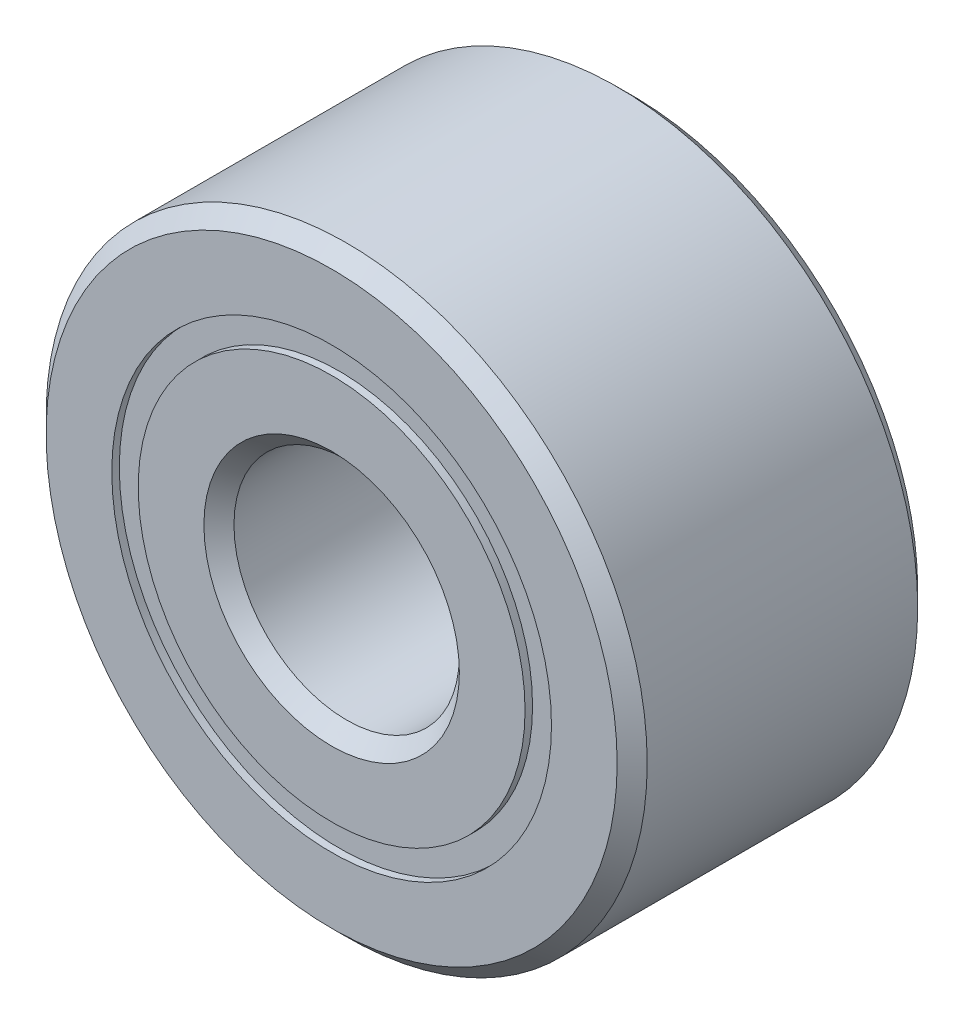
ISO-10303-21;
HEADER;
FILE_DESCRIPTION(('STEP AP214'),'2;1');
FILE_NAME('part.step','',(''),(''),'','','');
FILE_SCHEMA(('AUTOMOTIVE_DESIGN { 1 0 10303 214 1 1 1 1 }'));
ENDSEC;
DATA;
#1=APPLICATION_CONTEXT('core data for automotive mechanical design processes');
#2=APPLICATION_PROTOCOL_DEFINITION('international standard','automotive_design',2000,#1);
#3=PRODUCT_CONTEXT('',#1,'mechanical');
#4=PRODUCT('Part','Part','',(#3));
#5=PRODUCT_RELATED_PRODUCT_CATEGORY('part','',(#4));
#6=PRODUCT_DEFINITION_FORMATION('','',#4);
#7=PRODUCT_DEFINITION_CONTEXT('part definition',#1,'design');
#8=PRODUCT_DEFINITION('design','',#6,#7);
#9=PRODUCT_DEFINITION_SHAPE('','',#8);
#10=(LENGTH_UNIT() NAMED_UNIT(*) SI_UNIT(.MILLI.,.METRE.));
#11=(NAMED_UNIT(*) PLANE_ANGLE_UNIT() SI_UNIT($,.RADIAN.));
#12=(NAMED_UNIT(*) SI_UNIT($,.STERADIAN.) SOLID_ANGLE_UNIT());
#13=UNCERTAINTY_MEASURE_WITH_UNIT(LENGTH_MEASURE(1.E-05),#10,'distance_accuracy_value','');
#14=(GEOMETRIC_REPRESENTATION_CONTEXT(3) GLOBAL_UNCERTAINTY_ASSIGNED_CONTEXT((#13)) GLOBAL_UNIT_ASSIGNED_CONTEXT((#10,
#11,#12)) REPRESENTATION_CONTEXT('',''));
#15=CARTESIAN_POINT('',(0.,0.,0.));
#16=DIRECTION('',(0.,0.,1.));
#17=DIRECTION('',(1.,0.,0.));
#18=AXIS2_PLACEMENT_3D('',#15,#16,#17);
#19=CARTESIAN_POINT('',(0.,2.92582417582418,-1.9));
#20=DIRECTION('',(0.,0.,1.));
#21=DIRECTION('',(1.,0.,0.));
#22=AXIS2_PLACEMENT_3D('',#19,#20,#21);
#23=PLANE('',#22);
#24=CARTESIAN_POINT('',(0.,0.,-1.9));
#25=DIRECTION('',(0.,0.,1.));
#26=DIRECTION('',(1.,0.,0.));
#27=AXIS2_PLACEMENT_3D('',#24,#25,#26);
#28=CIRCLE('',#27,2.92582417582418);
#29=CARTESIAN_POINT('',(2.92582417582418,0.,-1.9));
#30=VERTEX_POINT('',#29);
#31=EDGE_CURVE('E55',#30,#30,#28,.T.);
#32=ORIENTED_EDGE('',*,*,#31,.F.);
#33=EDGE_LOOP('',(#32));
#34=FACE_BOUND('',#33,.T.);
#35=CARTESIAN_POINT('',(0.,0.,-1.9));
#36=DIRECTION('',(0.,0.,1.));
#37=DIRECTION('',(1.,0.,0.));
#38=AXIS2_PLACEMENT_3D('',#35,#36,#37);
#39=CIRCLE('',#38,2.57417582417583);
#40=CARTESIAN_POINT('',(2.57417582417583,0.,-1.9));
#41=VERTEX_POINT('',#40);
#42=EDGE_CURVE('E11',#41,#41,#39,.T.);
#43=ORIENTED_EDGE('',*,*,#42,.T.);
#44=EDGE_LOOP('',(#43));
#45=FACE_BOUND('',#44,.T.);
#46=ADVANCED_FACE('F41',(#34,#45),#23,.F.);
#47=CARTESIAN_POINT('',(0.,0.,2.));
#48=DIRECTION('',(0.,0.,1.));
#49=DIRECTION('',(1.,0.,0.));
#50=AXIS2_PLACEMENT_3D('',#47,#48,#49);
#51=CYLINDRICAL_SURFACE('',#50,2.57417582417583);
#52=ORIENTED_EDGE('',*,*,#42,.F.);
#53=EDGE_LOOP('',(#52));
#54=FACE_BOUND('',#53,.T.);
#55=CARTESIAN_POINT('',(0.,0.,-0.90611125012019));
#56=DIRECTION('',(0.,0.,1.));
#57=DIRECTION('',(1.,0.,0.));
#58=AXIS2_PLACEMENT_3D('',#55,#56,#57);
#59=CIRCLE('',#58,2.57417582417583);
#60=CARTESIAN_POINT('',(2.57417582417583,0.,-0.90611125012019));
#61=VERTEX_POINT('',#60);
#62=EDGE_CURVE('E47',#61,#61,#59,.T.);
#63=ORIENTED_EDGE('',*,*,#62,.T.);
#64=EDGE_LOOP('',(#63));
#65=FACE_BOUND('',#64,.T.);
#66=ADVANCED_FACE('F64',(#54,#65),#51,.F.);
#67=CARTESIAN_POINT('',(0.,2.92582417582418,-0.90611125012019));
#68=DIRECTION('',(0.,0.,-1.));
#69=DIRECTION('',(-1.,0.,0.));
#70=AXIS2_PLACEMENT_3D('',#67,#68,#69);
#71=PLANE('',#70);
#72=ORIENTED_EDGE('',*,*,#62,.F.);
#73=EDGE_LOOP('',(#72));
#74=FACE_BOUND('',#73,.T.);
#75=CARTESIAN_POINT('',(0.,0.,-0.90611125012019));
#76=DIRECTION('',(0.,0.,1.));
#77=DIRECTION('',(1.,0.,0.));
#78=AXIS2_PLACEMENT_3D('',#75,#76,#77);
#79=CIRCLE('',#78,2.92582417582418);
#80=CARTESIAN_POINT('',(2.92582417582418,0.,-0.90611125012019));
#81=VERTEX_POINT('',#80);
#82=EDGE_CURVE('E51',#81,#81,#79,.T.);
#83=ORIENTED_EDGE('',*,*,#82,.T.);
#84=EDGE_LOOP('',(#83));
#85=FACE_BOUND('',#84,.T.);
#86=ADVANCED_FACE('F68',(#74,#85),#71,.F.);
#87=CARTESIAN_POINT('',(0.,0.,2.));
#88=DIRECTION('',(0.,0.,1.));
#89=DIRECTION('',(1.,0.,0.));
#90=AXIS2_PLACEMENT_3D('',#87,#88,#89);
#91=CYLINDRICAL_SURFACE('',#90,2.92582417582418);
#92=ORIENTED_EDGE('',*,*,#82,.F.);
#93=EDGE_LOOP('',(#92));
#94=FACE_BOUND('',#93,.T.);
#95=ORIENTED_EDGE('',*,*,#31,.T.);
#96=EDGE_LOOP('',(#95));
#97=FACE_BOUND('',#96,.T.);
#98=ADVANCED_FACE('F61',(#94,#97),#91,.T.);
#99=CLOSED_SHELL('',(#46,#66,#86,#98));
#100=MANIFOLD_SOLID_BREP('B2',#99);
#101=CARTESIAN_POINT('',(0.,2.92582417582418,1.9));
#102=DIRECTION('',(0.,0.,-1.));
#103=DIRECTION('',(-1.,0.,0.));
#104=AXIS2_PLACEMENT_3D('',#101,#102,#103);
#105=PLANE('',#104);
#106=CARTESIAN_POINT('',(0.,0.,1.9));
#107=DIRECTION('',(0.,0.,1.));
#108=DIRECTION('',(1.,0.,0.));
#109=AXIS2_PLACEMENT_3D('',#106,#107,#108);
#110=CIRCLE('',#109,2.57417582417583);
#111=CARTESIAN_POINT('',(2.57417582417583,0.,1.9));
#112=VERTEX_POINT('',#111);
#113=EDGE_CURVE('E40',#112,#112,#110,.T.);
#114=ORIENTED_EDGE('',*,*,#113,.F.);
#115=EDGE_LOOP('',(#114));
#116=FACE_BOUND('',#115,.T.);
#117=CARTESIAN_POINT('',(0.,0.,1.9));
#118=DIRECTION('',(0.,0.,1.));
#119=DIRECTION('',(1.,0.,0.));
#120=AXIS2_PLACEMENT_3D('',#117,#118,#119);
#121=CIRCLE('',#120,2.92582417582418);
#122=CARTESIAN_POINT('',(2.92582417582418,0.,1.9));
#123=VERTEX_POINT('',#122);
#124=EDGE_CURVE('E122',#123,#123,#121,.T.);
#125=ORIENTED_EDGE('',*,*,#124,.T.);
#126=EDGE_LOOP('',(#125));
#127=FACE_BOUND('',#126,.T.);
#128=ADVANCED_FACE('F108',(#116,#127),#105,.F.);
#129=CARTESIAN_POINT('',(0.,0.,2.));
#130=DIRECTION('',(0.,0.,1.));
#131=DIRECTION('',(1.,0.,0.));
#132=AXIS2_PLACEMENT_3D('',#129,#130,#131);
#133=CYLINDRICAL_SURFACE('',#132,2.57417582417583);
#134=CARTESIAN_POINT('',(0.,0.,0.90611125012019));
#135=DIRECTION('',(0.,0.,1.));
#136=DIRECTION('',(1.,0.,0.));
#137=AXIS2_PLACEMENT_3D('',#134,#135,#136);
#138=CIRCLE('',#137,2.57417582417583);
#139=CARTESIAN_POINT('',(2.57417582417583,0.,0.90611125012019));
#140=VERTEX_POINT('',#139);
#141=EDGE_CURVE('E114',#140,#140,#138,.T.);
#142=ORIENTED_EDGE('',*,*,#141,.F.);
#143=EDGE_LOOP('',(#142));
#144=FACE_BOUND('',#143,.T.);
#145=ORIENTED_EDGE('',*,*,#113,.T.);
#146=EDGE_LOOP('',(#145));
#147=FACE_BOUND('',#146,.T.);
#148=ADVANCED_FACE('F137',(#144,#147),#133,.F.);
#149=CARTESIAN_POINT('',(0.,2.92582417582418,0.90611125012019));
#150=DIRECTION('',(0.,0.,1.));
#151=DIRECTION('',(1.,0.,0.));
#152=AXIS2_PLACEMENT_3D('',#149,#150,#151);
#153=PLANE('',#152);
#154=CARTESIAN_POINT('',(0.,0.,0.90611125012019));
#155=DIRECTION('',(0.,0.,1.));
#156=DIRECTION('',(1.,0.,0.));
#157=AXIS2_PLACEMENT_3D('',#154,#155,#156);
#158=CIRCLE('',#157,2.92582417582418);
#159=CARTESIAN_POINT('',(2.92582417582418,0.,0.90611125012019));
#160=VERTEX_POINT('',#159);
#161=EDGE_CURVE('E118',#160,#160,#158,.T.);
#162=ORIENTED_EDGE('',*,*,#161,.F.);
#163=EDGE_LOOP('',(#162));
#164=FACE_BOUND('',#163,.T.);
#165=ORIENTED_EDGE('',*,*,#141,.T.);
#166=EDGE_LOOP('',(#165));
#167=FACE_BOUND('',#166,.T.);
#168=ADVANCED_FACE('F132',(#164,#167),#153,.F.);
#169=CARTESIAN_POINT('',(0.,0.,2.));
#170=DIRECTION('',(0.,0.,1.));
#171=DIRECTION('',(1.,0.,0.));
#172=AXIS2_PLACEMENT_3D('',#169,#170,#171);
#173=CYLINDRICAL_SURFACE('',#172,2.92582417582418);
#174=ORIENTED_EDGE('',*,*,#124,.F.);
#175=EDGE_LOOP('',(#174));
#176=FACE_BOUND('',#175,.T.);
#177=ORIENTED_EDGE('',*,*,#161,.T.);
#178=EDGE_LOOP('',(#177));
#179=FACE_BOUND('',#178,.T.);
#180=ADVANCED_FACE('F129',(#176,#179),#173,.T.);
#181=CLOSED_SHELL('',(#128,#148,#168,#180));
#182=MANIFOLD_SOLID_BREP('B6',#181);
#183=CARTESIAN_POINT('',(-1.37499999999997,2.38156986040722,0.));
#184=DIRECTION('',(0.,0.,1.));
#185=DIRECTION('',(-0.499999999999989,0.866025403784445,0.));
#186=AXIS2_PLACEMENT_3D('',#183,#184,#185);
#187=SPHERICAL_SURFACE('',#186,0.90611125012019);
#188=CARTESIAN_POINT('',(-1.37499999999997,2.38156986040722,0.90611125012019));
#189=VERTEX_POINT('',#188);
#190=VERTEX_LOOP('',#189);
#191=FACE_BOUND('',#190,.T.);
#192=ADVANCED_FACE('F175',(#191),#187,.T.);
#193=CLOSED_SHELL('',(#192));
#194=MANIFOLD_SOLID_BREP('B35',#193);
#195=CARTESIAN_POINT('',(-2.38156986040719,1.37500000000003,0.));
#196=DIRECTION('',(0.,0.,1.));
#197=DIRECTION('',(-0.866025403784433,0.50000000000001,0.));
#198=AXIS2_PLACEMENT_3D('',#195,#196,#197);
#199=SPHERICAL_SURFACE('',#198,0.90611125012019);
#200=CARTESIAN_POINT('',(-2.38156986040719,1.37500000000003,0.90611125012019));
#201=VERTEX_POINT('',#200);
#202=VERTEX_LOOP('',#201);
#203=FACE_BOUND('',#202,.T.);
#204=ADVANCED_FACE('F195',(#203),#199,.T.);
#205=CLOSED_SHELL('',(#204));
#206=MANIFOLD_SOLID_BREP('B104',#205);
#207=CARTESIAN_POINT('',(-2.75,0.,0.));
#208=DIRECTION('',(0.,0.,1.));
#209=DIRECTION('',(-1.,0.,0.));
#210=AXIS2_PLACEMENT_3D('',#207,#208,#209);
#211=SPHERICAL_SURFACE('',#210,0.90611125012019);
#212=CARTESIAN_POINT('',(-2.75,0.,0.90611125012019));
#213=VERTEX_POINT('',#212);
#214=VERTEX_LOOP('',#213);
#215=FACE_BOUND('',#214,.T.);
#216=ADVANCED_FACE('F215',(#215),#211,.T.);
#217=CLOSED_SHELL('',(#216));
#218=MANIFOLD_SOLID_BREP('B171',#217);
#219=CARTESIAN_POINT('',(-2.38156986040722,-1.37499999999998,0.));
#220=DIRECTION('',(0.,0.,1.));
#221=DIRECTION('',(-0.866025403784443,-0.499999999999992,0.));
#222=AXIS2_PLACEMENT_3D('',#219,#220,#221);
#223=SPHERICAL_SURFACE('',#222,0.90611125012019);
#224=CARTESIAN_POINT('',(-2.38156986040722,-1.37499999999998,0.90611125012019));
#225=VERTEX_POINT('',#224);
#226=VERTEX_LOOP('',#225);
#227=FACE_BOUND('',#226,.T.);
#228=ADVANCED_FACE('F235',(#227),#223,.T.);
#229=CLOSED_SHELL('',(#228));
#230=MANIFOLD_SOLID_BREP('B191',#229);
#231=CARTESIAN_POINT('',(-1.37500000000002,-2.3815698604072,0.));
#232=DIRECTION('',(0.,0.,1.));
#233=DIRECTION('',(-0.500000000000007,-0.866025403784435,0.));
#234=AXIS2_PLACEMENT_3D('',#231,#232,#233);
#235=SPHERICAL_SURFACE('',#234,0.90611125012019);
#236=CARTESIAN_POINT('',(-1.37500000000002,-2.3815698604072,0.90611125012019));
#237=VERTEX_POINT('',#236);
#238=VERTEX_LOOP('',#237);
#239=FACE_BOUND('',#238,.T.);
#240=ADVANCED_FACE('F255',(#239),#235,.T.);
#241=CLOSED_SHELL('',(#240));
#242=MANIFOLD_SOLID_BREP('B211',#241);
#243=CARTESIAN_POINT('',(0.,-2.75,0.));
#244=DIRECTION('',(0.,0.,1.));
#245=DIRECTION('',(0.,-1.,0.));
#246=AXIS2_PLACEMENT_3D('',#243,#244,#245);
#247=SPHERICAL_SURFACE('',#246,0.90611125012019);
#248=CARTESIAN_POINT('',(0.,-2.75,0.90611125012019));
#249=VERTEX_POINT('',#248);
#250=VERTEX_LOOP('',#249);
#251=FACE_BOUND('',#250,.T.);
#252=ADVANCED_FACE('F275',(#251),#247,.T.);
#253=CLOSED_SHELL('',(#252));
#254=MANIFOLD_SOLID_BREP('B231',#253);
#255=CARTESIAN_POINT('',(1.37499999999999,-2.38156986040721,0.));
#256=DIRECTION('',(0.,0.,1.));
#257=DIRECTION('',(0.499999999999995,-0.866025403784442,0.));
#258=AXIS2_PLACEMENT_3D('',#255,#256,#257);
#259=SPHERICAL_SURFACE('',#258,0.90611125012019);
#260=CARTESIAN_POINT('',(1.37499999999999,-2.38156986040721,0.90611125012019));
#261=VERTEX_POINT('',#260);
#262=VERTEX_LOOP('',#261);
#263=FACE_BOUND('',#262,.T.);
#264=ADVANCED_FACE('F295',(#263),#259,.T.);
#265=CLOSED_SHELL('',(#264));
#266=MANIFOLD_SOLID_BREP('B251',#265);
#267=CARTESIAN_POINT('',(2.3815698604072,-1.37500000000001,0.));
#268=DIRECTION('',(0.,0.,1.));
#269=DIRECTION('',(0.866025403784436,-0.500000000000004,0.));
#270=AXIS2_PLACEMENT_3D('',#267,#268,#269);
#271=SPHERICAL_SURFACE('',#270,0.90611125012019);
#272=CARTESIAN_POINT('',(2.3815698604072,-1.37500000000001,0.90611125012019));
#273=VERTEX_POINT('',#272);
#274=VERTEX_LOOP('',#273);
#275=FACE_BOUND('',#274,.T.);
#276=ADVANCED_FACE('F315',(#275),#271,.T.);
#277=CLOSED_SHELL('',(#276));
#278=MANIFOLD_SOLID_BREP('B271',#277);
#279=CARTESIAN_POINT('',(2.75,0.,0.));
#280=DIRECTION('',(0.,0.,1.));
#281=DIRECTION('',(1.,0.,0.));
#282=AXIS2_PLACEMENT_3D('',#279,#280,#281);
#283=SPHERICAL_SURFACE('',#282,0.90611125012019);
#284=CARTESIAN_POINT('',(2.75,0.,0.90611125012019));
#285=VERTEX_POINT('',#284);
#286=VERTEX_LOOP('',#285);
#287=FACE_BOUND('',#286,.T.);
#288=ADVANCED_FACE('F335',(#287),#283,.T.);
#289=CLOSED_SHELL('',(#288));
#290=MANIFOLD_SOLID_BREP('B291',#289);
#291=CARTESIAN_POINT('',(2.38156986040721,1.37499999999999,0.));
#292=DIRECTION('',(0.,0.,1.));
#293=DIRECTION('',(0.86602540378444,0.499999999999998,0.));
#294=AXIS2_PLACEMENT_3D('',#291,#292,#293);
#295=SPHERICAL_SURFACE('',#294,0.90611125012019);
#296=CARTESIAN_POINT('',(2.38156986040721,1.37499999999999,0.90611125012019));
#297=VERTEX_POINT('',#296);
#298=VERTEX_LOOP('',#297);
#299=FACE_BOUND('',#298,.T.);
#300=ADVANCED_FACE('F355',(#299),#295,.T.);
#301=CLOSED_SHELL('',(#300));
#302=MANIFOLD_SOLID_BREP('B311',#301);
#303=CARTESIAN_POINT('',(1.375,2.3815698604072,0.));
#304=DIRECTION('',(0.,0.,1.));
#305=DIRECTION('',(0.500000000000001,0.866025403784438,0.));
#306=AXIS2_PLACEMENT_3D('',#303,#304,#305);
#307=SPHERICAL_SURFACE('',#306,0.90611125012019);
#308=CARTESIAN_POINT('',(1.375,2.3815698604072,0.90611125012019));
#309=VERTEX_POINT('',#308);
#310=VERTEX_LOOP('',#309);
#311=FACE_BOUND('',#310,.T.);
#312=ADVANCED_FACE('F375',(#311),#307,.T.);
#313=CLOSED_SHELL('',(#312));
#314=MANIFOLD_SOLID_BREP('B331',#313);
#315=CARTESIAN_POINT('',(0.,2.75,0.));
#316=DIRECTION('',(0.,0.,1.));
#317=DIRECTION('',(0.,1.,0.));
#318=AXIS2_PLACEMENT_3D('',#315,#316,#317);
#319=SPHERICAL_SURFACE('',#318,0.90611125012019);
#320=CARTESIAN_POINT('',(0.,2.75,0.90611125012019));
#321=VERTEX_POINT('',#320);
#322=VERTEX_LOOP('',#321);
#323=FACE_BOUND('',#322,.T.);
#324=ADVANCED_FACE('F397',(#323),#319,.T.);
#325=CLOSED_SHELL('',(#324));
#326=MANIFOLD_SOLID_BREP('B351',#325);
#327=CARTESIAN_POINT('',(0.,2.57417582417583,2.));
#328=DIRECTION('',(0.,0.,-1.));
#329=DIRECTION('',(-1.,0.,0.));
#330=AXIS2_PLACEMENT_3D('',#327,#328,#329);
#331=PLANE('',#330);
#332=CARTESIAN_POINT('',(0.,0.,2.));
#333=DIRECTION('',(0.,0.,1.));
#334=DIRECTION('',(1.,0.,0.));
#335=AXIS2_PLACEMENT_3D('',#332,#333,#334);
#336=CIRCLE('',#335,1.7);
#337=CARTESIAN_POINT('',(1.7,0.,2.));
#338=VERTEX_POINT('',#337);
#339=EDGE_CURVE('E444',#338,#338,#336,.T.);
#340=ORIENTED_EDGE('',*,*,#339,.F.);
#341=EDGE_LOOP('',(#340));
#342=FACE_BOUND('',#341,.T.);
#343=CARTESIAN_POINT('',(0.,0.,2.));
#344=DIRECTION('',(0.,0.,1.));
#345=DIRECTION('',(1.,0.,0.));
#346=AXIS2_PLACEMENT_3D('',#343,#344,#345);
#347=CIRCLE('',#346,2.57417582417583);
#348=CARTESIAN_POINT('',(2.57417582417583,0.,2.));
#349=VERTEX_POINT('',#348);
#350=EDGE_CURVE('E396',#349,#349,#347,.T.);
#351=ORIENTED_EDGE('',*,*,#350,.T.);
#352=EDGE_LOOP('',(#351));
#353=FACE_BOUND('',#352,.T.);
#354=ADVANCED_FACE('F416',(#342,#353),#331,.F.);
#355=CARTESIAN_POINT('',(0.,0.,2.));
#356=DIRECTION('',(0.,0.,1.));
#357=DIRECTION('',(1.,0.,0.));
#358=AXIS2_PLACEMENT_3D('',#355,#356,#357);
#359=CYLINDRICAL_SURFACE('',#358,2.57417582417583);
#360=ORIENTED_EDGE('',*,*,#350,.F.);
#361=EDGE_LOOP('',(#360));
#362=FACE_BOUND('',#361,.T.);
#363=CARTESIAN_POINT('',(0.,0.,0.888888888888889));
#364=DIRECTION('',(0.,0.,1.));
#365=DIRECTION('',(1.,0.,0.));
#366=AXIS2_PLACEMENT_3D('',#363,#364,#365);
#367=CIRCLE('',#366,2.57417582417583);
#368=CARTESIAN_POINT('',(2.57417582417583,0.,0.888888888888889));
#369=VERTEX_POINT('',#368);
#370=EDGE_CURVE('E422',#369,#369,#367,.T.);
#371=ORIENTED_EDGE('',*,*,#370,.T.);
#372=EDGE_LOOP('',(#371));
#373=FACE_BOUND('',#372,.T.);
#374=ADVANCED_FACE('F451',(#362,#373),#359,.T.);
#375=CARTESIAN_POINT('',(0.,0.,0.));
#376=DIRECTION('',(0.,0.,1.));
#377=DIRECTION('',(1.,0.,0.));
#378=AXIS2_PLACEMENT_3D('',#375,#376,#377);
#379=TOROIDAL_SURFACE('',#378,2.75,0.906111250120189);
#380=ORIENTED_EDGE('',*,*,#370,.F.);
#381=EDGE_LOOP('',(#380));
#382=FACE_BOUND('',#381,.T.);
#383=CARTESIAN_POINT('',(0.,0.,-0.88888888888889));
#384=DIRECTION('',(0.,0.,1.));
#385=DIRECTION('',(1.,0.,0.));
#386=AXIS2_PLACEMENT_3D('',#383,#384,#385);
#387=CIRCLE('',#386,2.57417582417583);
#388=CARTESIAN_POINT('',(2.57417582417583,0.,-0.88888888888889));
#389=VERTEX_POINT('',#388);
#390=EDGE_CURVE('E426',#389,#389,#387,.T.);
#391=ORIENTED_EDGE('',*,*,#390,.T.);
#392=EDGE_LOOP('',(#391));
#393=FACE_BOUND('',#392,.T.);
#394=ADVANCED_FACE('F455',(#382,#393),#379,.F.);
#395=CARTESIAN_POINT('',(0.,0.,2.));
#396=DIRECTION('',(0.,0.,1.));
#397=DIRECTION('',(1.,0.,0.));
#398=AXIS2_PLACEMENT_3D('',#395,#396,#397);
#399=CYLINDRICAL_SURFACE('',#398,2.57417582417583);
#400=ORIENTED_EDGE('',*,*,#390,.F.);
#401=EDGE_LOOP('',(#400));
#402=FACE_BOUND('',#401,.T.);
#403=CARTESIAN_POINT('',(0.,0.,-2.));
#404=DIRECTION('',(0.,0.,1.));
#405=DIRECTION('',(1.,0.,0.));
#406=AXIS2_PLACEMENT_3D('',#403,#404,#405);
#407=CIRCLE('',#406,2.57417582417583);
#408=CARTESIAN_POINT('',(2.57417582417583,0.,-2.));
#409=VERTEX_POINT('',#408);
#410=EDGE_CURVE('E430',#409,#409,#407,.T.);
#411=ORIENTED_EDGE('',*,*,#410,.T.);
#412=EDGE_LOOP('',(#411));
#413=FACE_BOUND('',#412,.T.);
#414=ADVANCED_FACE('F460',(#402,#413),#399,.T.);
#415=CARTESIAN_POINT('',(0.,1.7,-2.));
#416=DIRECTION('',(0.,0.,1.));
#417=DIRECTION('',(1.,0.,0.));
#418=AXIS2_PLACEMENT_3D('',#415,#416,#417);
#419=PLANE('',#418);
#420=ORIENTED_EDGE('',*,*,#410,.F.);
#421=EDGE_LOOP('',(#420));
#422=FACE_BOUND('',#421,.T.);
#423=CARTESIAN_POINT('',(0.,0.,-2.));
#424=DIRECTION('',(0.,0.,1.));
#425=DIRECTION('',(1.,0.,0.));
#426=AXIS2_PLACEMENT_3D('',#423,#424,#425);
#427=CIRCLE('',#426,1.7);
#428=CARTESIAN_POINT('',(1.7,0.,-2.));
#429=VERTEX_POINT('',#428);
#430=EDGE_CURVE('E435',#429,#429,#427,.T.);
#431=ORIENTED_EDGE('',*,*,#430,.T.);
#432=EDGE_LOOP('',(#431));
#433=FACE_BOUND('',#432,.T.);
#434=ADVANCED_FACE('F466',(#422,#433),#419,.F.);
#435=CARTESIAN_POINT('',(0.,0.,-1.8));
#436=DIRECTION('',(0.,0.,-1.));
#437=DIRECTION('',(-1.,0.,0.));
#438=AXIS2_PLACEMENT_3D('',#435,#436,#437);
#439=CONICAL_SURFACE('',#438,1.5,0.785398163397448);
#440=ORIENTED_EDGE('',*,*,#430,.F.);
#441=EDGE_LOOP('',(#440));
#442=FACE_BOUND('',#441,.T.);
#443=CARTESIAN_POINT('',(0.,0.,-1.8));
#444=DIRECTION('',(0.,0.,1.));
#445=DIRECTION('',(1.,0.,0.));
#446=AXIS2_PLACEMENT_3D('',#443,#444,#445);
#447=CIRCLE('',#446,1.5);
#448=CARTESIAN_POINT('',(1.5,0.,-1.8));
#449=VERTEX_POINT('',#448);
#450=EDGE_CURVE('E438',#449,#449,#447,.T.);
#451=ORIENTED_EDGE('',*,*,#450,.T.);
#452=EDGE_LOOP('',(#451));
#453=FACE_BOUND('',#452,.T.);
#454=ADVANCED_FACE('F470',(#442,#453),#439,.F.);
#455=CARTESIAN_POINT('',(0.,0.,2.));
#456=DIRECTION('',(0.,0.,1.));
#457=DIRECTION('',(1.,0.,0.));
#458=AXIS2_PLACEMENT_3D('',#455,#456,#457);
#459=CYLINDRICAL_SURFACE('',#458,1.5);
#460=ORIENTED_EDGE('',*,*,#450,.F.);
#461=EDGE_LOOP('',(#460));
#462=FACE_BOUND('',#461,.T.);
#463=CARTESIAN_POINT('',(0.,0.,1.8));
#464=DIRECTION('',(0.,0.,1.));
#465=DIRECTION('',(1.,0.,0.));
#466=AXIS2_PLACEMENT_3D('',#463,#464,#465);
#467=CIRCLE('',#466,1.5);
#468=CARTESIAN_POINT('',(1.5,0.,1.8));
#469=VERTEX_POINT('',#468);
#470=EDGE_CURVE('E441',#469,#469,#467,.T.);
#471=ORIENTED_EDGE('',*,*,#470,.T.);
#472=EDGE_LOOP('',(#471));
#473=FACE_BOUND('',#472,.T.);
#474=ADVANCED_FACE('F474',(#462,#473),#459,.F.);
#475=CARTESIAN_POINT('',(0.,0.,2.));
#476=DIRECTION('',(0.,0.,1.));
#477=DIRECTION('',(1.,0.,0.));
#478=AXIS2_PLACEMENT_3D('',#475,#476,#477);
#479=CONICAL_SURFACE('',#478,1.7,0.785398163397449);
#480=ORIENTED_EDGE('',*,*,#470,.F.);
#481=EDGE_LOOP('',(#480));
#482=FACE_BOUND('',#481,.T.);
#483=ORIENTED_EDGE('',*,*,#339,.T.);
#484=EDGE_LOOP('',(#483));
#485=FACE_BOUND('',#484,.T.);
#486=ADVANCED_FACE('F448',(#482,#485),#479,.F.);
#487=CLOSED_SHELL('',(#354,#374,#394,#414,#434,#454,#474,#486));
#488=MANIFOLD_SOLID_BREP('B371',#487);
#489=CARTESIAN_POINT('',(0.,0.,1.8));
#490=DIRECTION('',(0.,0.,-1.));
#491=DIRECTION('',(-1.,0.,0.));
#492=AXIS2_PLACEMENT_3D('',#489,#490,#491);
#493=CONICAL_SURFACE('',#492,4.,0.785398163397446);
#494=CARTESIAN_POINT('',(0.,0.,2.));
#495=DIRECTION('',(0.,0.,1.));
#496=DIRECTION('',(1.,0.,0.));
#497=AXIS2_PLACEMENT_3D('',#494,#495,#496);
#498=CIRCLE('',#497,3.8);
#499=CARTESIAN_POINT('',(3.8,0.,2.));
#500=VERTEX_POINT('',#499);
#501=EDGE_CURVE('E565',#500,#500,#498,.T.);
#502=ORIENTED_EDGE('',*,*,#501,.F.);
#503=EDGE_LOOP('',(#502));
#504=FACE_BOUND('',#503,.T.);
#505=CARTESIAN_POINT('',(0.,0.,1.8));
#506=DIRECTION('',(0.,0.,1.));
#507=DIRECTION('',(1.,0.,0.));
#508=AXIS2_PLACEMENT_3D('',#505,#506,#507);
#509=CIRCLE('',#508,4.);
#510=CARTESIAN_POINT('',(4.,0.,1.8));
#511=VERTEX_POINT('',#510);
#512=EDGE_CURVE('E415',#511,#511,#509,.T.);
#513=ORIENTED_EDGE('',*,*,#512,.T.);
#514=EDGE_LOOP('',(#513));
#515=FACE_BOUND('',#514,.T.);
#516=ADVANCED_FACE('F537',(#504,#515),#493,.T.);
#517=CARTESIAN_POINT('',(0.,0.,2.));
#518=DIRECTION('',(0.,0.,1.));
#519=DIRECTION('',(1.,0.,0.));
#520=AXIS2_PLACEMENT_3D('',#517,#518,#519);
#521=CYLINDRICAL_SURFACE('',#520,4.);
#522=ORIENTED_EDGE('',*,*,#512,.F.);
#523=EDGE_LOOP('',(#522));
#524=FACE_BOUND('',#523,.T.);
#525=CARTESIAN_POINT('',(0.,0.,-1.8));
#526=DIRECTION('',(0.,0.,1.));
#527=DIRECTION('',(1.,0.,0.));
#528=AXIS2_PLACEMENT_3D('',#525,#526,#527);
#529=CIRCLE('',#528,4.);
#530=CARTESIAN_POINT('',(4.,0.,-1.8));
#531=VERTEX_POINT('',#530);
#532=EDGE_CURVE('E543',#531,#531,#529,.T.);
#533=ORIENTED_EDGE('',*,*,#532,.T.);
#534=EDGE_LOOP('',(#533));
#535=FACE_BOUND('',#534,.T.);
#536=ADVANCED_FACE('F572',(#524,#535),#521,.T.);
#537=CARTESIAN_POINT('',(0.,0.,-2.));
#538=DIRECTION('',(0.,0.,1.));
#539=DIRECTION('',(1.,0.,0.));
#540=AXIS2_PLACEMENT_3D('',#537,#538,#539);
#541=CONICAL_SURFACE('',#540,3.8,0.785398163397447);
#542=ORIENTED_EDGE('',*,*,#532,.F.);
#543=EDGE_LOOP('',(#542));
#544=FACE_BOUND('',#543,.T.);
#545=CARTESIAN_POINT('',(0.,0.,-2.));
#546=DIRECTION('',(0.,0.,1.));
#547=DIRECTION('',(1.,0.,0.));
#548=AXIS2_PLACEMENT_3D('',#545,#546,#547);
#549=CIRCLE('',#548,3.8);
#550=CARTESIAN_POINT('',(3.8,0.,-2.));
#551=VERTEX_POINT('',#550);
#552=EDGE_CURVE('E547',#551,#551,#549,.T.);
#553=ORIENTED_EDGE('',*,*,#552,.T.);
#554=EDGE_LOOP('',(#553));
#555=FACE_BOUND('',#554,.T.);
#556=ADVANCED_FACE('F576',(#544,#555),#541,.T.);
#557=CARTESIAN_POINT('',(0.,3.8,-2.));
#558=DIRECTION('',(0.,0.,1.));
#559=DIRECTION('',(1.,0.,0.));
#560=AXIS2_PLACEMENT_3D('',#557,#558,#559);
#561=PLANE('',#560);
#562=ORIENTED_EDGE('',*,*,#552,.F.);
#563=EDGE_LOOP('',(#562));
#564=FACE_BOUND('',#563,.T.);
#565=CARTESIAN_POINT('',(0.,0.,-2.));
#566=DIRECTION('',(0.,0.,1.));
#567=DIRECTION('',(1.,0.,0.));
#568=AXIS2_PLACEMENT_3D('',#565,#566,#567);
#569=CIRCLE('',#568,2.92582417582418);
#570=CARTESIAN_POINT('',(2.92582417582418,0.,-2.));
#571=VERTEX_POINT('',#570);
#572=EDGE_CURVE('E551',#571,#571,#569,.T.);
#573=ORIENTED_EDGE('',*,*,#572,.T.);
#574=EDGE_LOOP('',(#573));
#575=FACE_BOUND('',#574,.T.);
#576=ADVANCED_FACE('F581',(#564,#575),#561,.F.);
#577=CARTESIAN_POINT('',(0.,0.,2.));
#578=DIRECTION('',(0.,0.,1.));
#579=DIRECTION('',(1.,0.,0.));
#580=AXIS2_PLACEMENT_3D('',#577,#578,#579);
#581=CYLINDRICAL_SURFACE('',#580,2.92582417582418);
#582=ORIENTED_EDGE('',*,*,#572,.F.);
#583=EDGE_LOOP('',(#582));
#584=FACE_BOUND('',#583,.T.);
#585=CARTESIAN_POINT('',(0.,0.,-0.888888888888889));
#586=DIRECTION('',(0.,0.,1.));
#587=DIRECTION('',(1.,0.,0.));
#588=AXIS2_PLACEMENT_3D('',#585,#586,#587);
#589=CIRCLE('',#588,2.92582417582418);
#590=CARTESIAN_POINT('',(2.92582417582418,0.,-0.888888888888889));
#591=VERTEX_POINT('',#590);
#592=EDGE_CURVE('E556',#591,#591,#589,.T.);
#593=ORIENTED_EDGE('',*,*,#592,.T.);
#594=EDGE_LOOP('',(#593));
#595=FACE_BOUND('',#594,.T.);
#596=ADVANCED_FACE('F587',(#584,#595),#581,.F.);
#597=CARTESIAN_POINT('',(0.,0.,0.));
#598=DIRECTION('',(0.,0.,1.));
#599=DIRECTION('',(1.,0.,0.));
#600=AXIS2_PLACEMENT_3D('',#597,#598,#599);
#601=TOROIDAL_SURFACE('',#600,2.75,0.90611125012019);
#602=ORIENTED_EDGE('',*,*,#592,.F.);
#603=EDGE_LOOP('',(#602));
#604=FACE_BOUND('',#603,.T.);
#605=CARTESIAN_POINT('',(0.,0.,0.888888888888889));
#606=DIRECTION('',(0.,0.,1.));
#607=DIRECTION('',(1.,0.,0.));
#608=AXIS2_PLACEMENT_3D('',#605,#606,#607);
#609=CIRCLE('',#608,2.92582417582418);
#610=CARTESIAN_POINT('',(2.92582417582418,0.,0.888888888888889));
#611=VERTEX_POINT('',#610);
#612=EDGE_CURVE('E559',#611,#611,#609,.T.);
#613=ORIENTED_EDGE('',*,*,#612,.T.);
#614=EDGE_LOOP('',(#613));
#615=FACE_BOUND('',#614,.T.);
#616=ADVANCED_FACE('F591',(#604,#615),#601,.F.);
#617=CARTESIAN_POINT('',(0.,0.,2.));
#618=DIRECTION('',(0.,0.,1.));
#619=DIRECTION('',(1.,0.,0.));
#620=AXIS2_PLACEMENT_3D('',#617,#618,#619);
#621=CYLINDRICAL_SURFACE('',#620,2.92582417582418);
#622=ORIENTED_EDGE('',*,*,#612,.F.);
#623=EDGE_LOOP('',(#622));
#624=FACE_BOUND('',#623,.T.);
#625=CARTESIAN_POINT('',(0.,0.,2.));
#626=DIRECTION('',(0.,0.,1.));
#627=DIRECTION('',(1.,0.,0.));
#628=AXIS2_PLACEMENT_3D('',#625,#626,#627);
#629=CIRCLE('',#628,2.92582417582418);
#630=CARTESIAN_POINT('',(2.92582417582418,0.,2.));
#631=VERTEX_POINT('',#630);
#632=EDGE_CURVE('E562',#631,#631,#629,.T.);
#633=ORIENTED_EDGE('',*,*,#632,.T.);
#634=EDGE_LOOP('',(#633));
#635=FACE_BOUND('',#634,.T.);
#636=ADVANCED_FACE('F595',(#624,#635),#621,.F.);
#637=CARTESIAN_POINT('',(0.,3.8,2.));
#638=DIRECTION('',(0.,0.,-1.));
#639=DIRECTION('',(-1.,0.,0.));
#640=AXIS2_PLACEMENT_3D('',#637,#638,#639);
#641=PLANE('',#640);
#642=ORIENTED_EDGE('',*,*,#632,.F.);
#643=EDGE_LOOP('',(#642));
#644=FACE_BOUND('',#643,.T.);
#645=ORIENTED_EDGE('',*,*,#501,.T.);
#646=EDGE_LOOP('',(#645));
#647=FACE_BOUND('',#646,.T.);
#648=ADVANCED_FACE('F569',(#644,#647),#641,.F.);
#649=CLOSED_SHELL('',(#516,#536,#556,#576,#596,#616,#636,#648));
#650=MANIFOLD_SOLID_BREP('B391',#649);
#651=ADVANCED_BREP_SHAPE_REPRESENTATION('',(#18,#100,#182,#194,#206,#218,#230,#242,#254,#266,
#278,#290,#302,#314,#326,#488,#650),#14);
#652=SHAPE_DEFINITION_REPRESENTATION(#9,#651);
ENDSEC;
END-ISO-10303-21;
